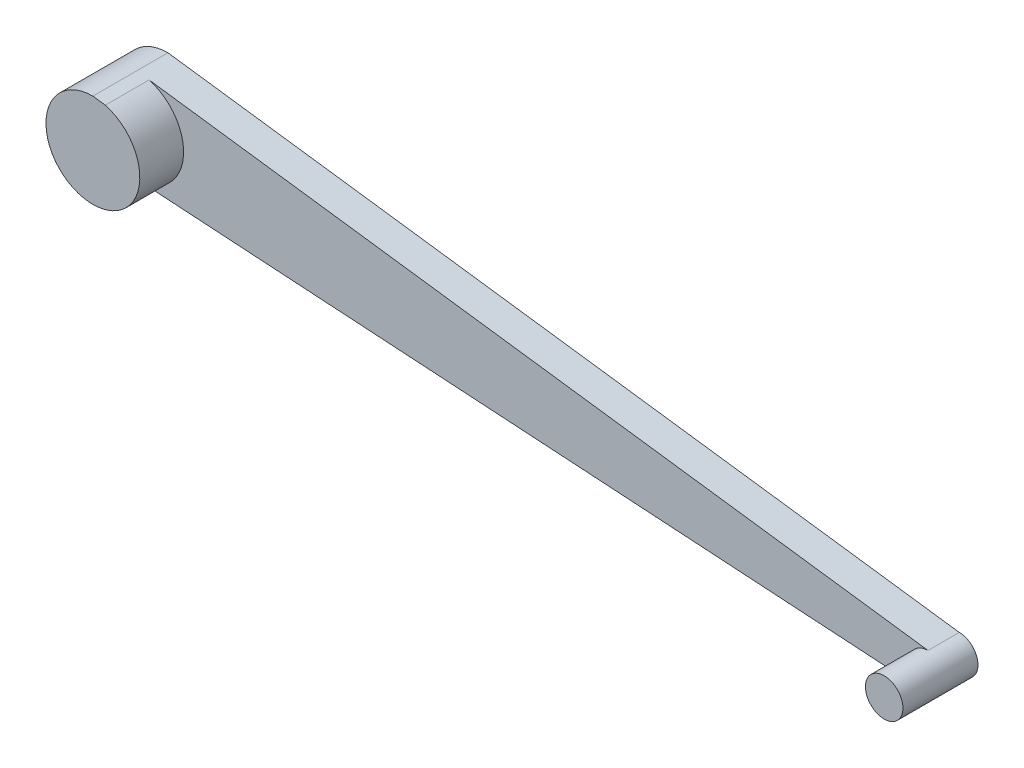
ISO-10303-21;
HEADER;
FILE_DESCRIPTION(('STEP AP214'),'2;1');
FILE_NAME('part.step','',(''),(''),'','','');
FILE_SCHEMA(('AUTOMOTIVE_DESIGN { 1 0 10303 214 1 1 1 1 }'));
ENDSEC;
DATA;
#1=APPLICATION_CONTEXT('core data for automotive mechanical design processes');
#2=APPLICATION_PROTOCOL_DEFINITION('international standard','automotive_design',2000,#1);
#3=PRODUCT_CONTEXT('',#1,'mechanical');
#4=PRODUCT('Part','Part','',(#3));
#5=PRODUCT_RELATED_PRODUCT_CATEGORY('part','',(#4));
#6=PRODUCT_DEFINITION_FORMATION('','',#4);
#7=PRODUCT_DEFINITION_CONTEXT('part definition',#1,'design');
#8=PRODUCT_DEFINITION('design','',#6,#7);
#9=PRODUCT_DEFINITION_SHAPE('','',#8);
#10=(LENGTH_UNIT() NAMED_UNIT(*) SI_UNIT(.MILLI.,.METRE.));
#11=(NAMED_UNIT(*) PLANE_ANGLE_UNIT() SI_UNIT($,.RADIAN.));
#12=(NAMED_UNIT(*) SI_UNIT($,.STERADIAN.) SOLID_ANGLE_UNIT());
#13=UNCERTAINTY_MEASURE_WITH_UNIT(LENGTH_MEASURE(1.E-05),#10,'distance_accuracy_value','');
#14=(GEOMETRIC_REPRESENTATION_CONTEXT(3) GLOBAL_UNCERTAINTY_ASSIGNED_CONTEXT((#13)) GLOBAL_UNIT_ASSIGNED_CONTEXT((#10,
#11,#12)) REPRESENTATION_CONTEXT('',''));
#15=CARTESIAN_POINT('',(0.,0.,0.));
#16=DIRECTION('',(0.,0.,1.));
#17=DIRECTION('',(1.,0.,0.));
#18=AXIS2_PLACEMENT_3D('',#15,#16,#17);
#19=CARTESIAN_POINT('',(-25.3,2.5,2.4));
#20=DIRECTION('',(0.,0.,-1.));
#21=DIRECTION('',(-1.,0.,0.));
#22=AXIS2_PLACEMENT_3D('',#19,#20,#21);
#23=CYLINDRICAL_SURFACE('',#22,1.5);
#24=DIRECTION('',(0.,0.,-1.));
#25=VECTOR('',#24,1.);
#26=CARTESIAN_POINT('',(-25.3,0.999999999999998,1.));
#27=LINE('',#26,#25);
#28=CARTESIAN_POINT('',(-25.3,0.999999999999993,1.));
#29=VERTEX_POINT('',#28);
#30=CARTESIAN_POINT('',(-25.3,0.999999999999993,0.));
#31=VERTEX_POINT('',#30);
#32=EDGE_CURVE('E63',#29,#31,#27,.T.);
#33=ORIENTED_EDGE('',*,*,#32,.F.);
#34=CARTESIAN_POINT('',(-25.3,2.5,1.));
#35=DIRECTION('',(0.,0.,1.));
#36=DIRECTION('',(1.,0.,0.));
#37=AXIS2_PLACEMENT_3D('',#34,#35,#36);
#38=CIRCLE('',#37,1.5);
#39=CARTESIAN_POINT('',(-24.9039898718637,3.94678124760223,1.));
#40=VERTEX_POINT('',#39);
#41=EDGE_CURVE('E68',#29,#40,#38,.T.);
#42=ORIENTED_EDGE('',*,*,#41,.T.);
#43=DIRECTION('',(0.,0.,-1.));
#44=VECTOR('',#43,1.);
#45=CARTESIAN_POINT('',(-24.9039898718637,3.94678124760223,2.4));
#46=LINE('',#45,#44);
#47=CARTESIAN_POINT('',(-24.9039898718637,3.94678124760223,2.4));
#48=VERTEX_POINT('',#47);
#49=EDGE_CURVE('E56',#48,#40,#46,.T.);
#50=ORIENTED_EDGE('',*,*,#49,.F.);
#51=CARTESIAN_POINT('',(-25.3,2.5,2.4));
#52=DIRECTION('',(0.,0.,1.));
#53=DIRECTION('',(1.,0.,0.));
#54=AXIS2_PLACEMENT_3D('',#51,#52,#53);
#55=CIRCLE('',#54,1.5);
#56=CARTESIAN_POINT('',(-25.3,4.,2.4));
#57=VERTEX_POINT('',#56);
#58=EDGE_CURVE('E152',#57,#48,#55,.T.);
#59=ORIENTED_EDGE('',*,*,#58,.F.);
#60=DIRECTION('',(0.,0.,-1.));
#61=VECTOR('',#60,1.);
#62=CARTESIAN_POINT('',(-25.3,4.,2.4));
#63=LINE('',#62,#61);
#64=CARTESIAN_POINT('',(-25.3,4.,0.));
#65=VERTEX_POINT('',#64);
#66=EDGE_CURVE('E11',#57,#65,#63,.T.);
#67=ORIENTED_EDGE('',*,*,#66,.T.);
#68=CARTESIAN_POINT('',(-25.3,2.5,0.));
#69=DIRECTION('',(0.,0.,1.));
#70=DIRECTION('',(1.,0.,0.));
#71=AXIS2_PLACEMENT_3D('',#68,#69,#70);
#72=CIRCLE('',#71,1.5);
#73=EDGE_CURVE('E153',#65,#31,#72,.T.);
#74=ORIENTED_EDGE('',*,*,#73,.T.);
#75=EDGE_LOOP('',(#33,#42,#50,#59,#67,#74));
#76=FACE_BOUND('',#75,.T.);
#77=ADVANCED_FACE('F47',(#76),#23,.T.);
#78=CARTESIAN_POINT('',(0.0792020256272538,0.589356249520448,2.4));
#79=DIRECTION('',(0.133190030154612,0.991090518503438,0.));
#80=DIRECTION('',(-0.991090518503438,0.133190030154612,0.));
#81=AXIS2_PLACEMENT_3D('',#78,#79,#80);
#82=PLANE('',#81);
#83=DIRECTION('',(0.991090518503438,-0.133190030154612,0.));
#84=VECTOR('',#83,1.);
#85=CARTESIAN_POINT('',(0.0792020256272538,0.589356249520448,0.));
#86=LINE('',#85,#84);
#87=CARTESIAN_POINT('',(0.,0.6,0.));
#88=VERTEX_POINT('',#87);
#89=EDGE_CURVE('E147',#65,#88,#86,.T.);
#90=ORIENTED_EDGE('',*,*,#89,.F.);
#91=ORIENTED_EDGE('',*,*,#66,.F.);
#92=DIRECTION('',(0.991090518503438,-0.133190030154612,0.));
#93=VECTOR('',#92,1.);
#94=CARTESIAN_POINT('',(0.0792020256272538,0.589356249520448,2.4));
#95=LINE('',#94,#93);
#96=EDGE_CURVE('E148',#57,#48,#95,.T.);
#97=ORIENTED_EDGE('',*,*,#96,.T.);
#98=ORIENTED_EDGE('',*,*,#49,.T.);
#99=DIRECTION('',(0.991090518503438,-0.133190030154612,0.));
#100=VECTOR('',#99,1.);
#101=CARTESIAN_POINT('',(0.0792020256272538,0.589356249520448,1.));
#102=LINE('',#101,#100);
#103=CARTESIAN_POINT('',(0.,0.6,1.));
#104=VERTEX_POINT('',#103);
#105=EDGE_CURVE('E137',#40,#104,#102,.T.);
#106=ORIENTED_EDGE('',*,*,#105,.T.);
#107=DIRECTION('',(0.,0.,-1.));
#108=VECTOR('',#107,1.);
#109=CARTESIAN_POINT('',(0.,0.6,1.));
#110=LINE('',#109,#108);
#111=EDGE_CURVE('E140',#104,#88,#110,.T.);
#112=ORIENTED_EDGE('',*,*,#111,.T.);
#113=EDGE_LOOP('',(#90,#91,#97,#98,#106,#112));
#114=FACE_BOUND('',#113,.T.);
#115=ADVANCED_FACE('F49',(#114),#82,.T.);
#116=CARTESIAN_POINT('',(0.,0.,2.4));
#117=DIRECTION('',(0.,0.,1.));
#118=DIRECTION('',(1.,0.,0.));
#119=AXIS2_PLACEMENT_3D('',#116,#117,#118);
#120=PLANE('',#119);
#121=ORIENTED_EDGE('',*,*,#96,.F.);
#122=ORIENTED_EDGE('',*,*,#58,.T.);
#123=EDGE_LOOP('',(#121,#122));
#124=FACE_BOUND('',#123,.T.);
#125=ADVANCED_FACE('F175',(#124),#120,.T.);
#126=CARTESIAN_POINT('',(0.,0.,0.));
#127=DIRECTION('',(0.,0.,1.));
#128=DIRECTION('',(1.,0.,0.));
#129=AXIS2_PLACEMENT_3D('',#126,#127,#128);
#130=PLANE('',#129);
#131=ORIENTED_EDGE('',*,*,#89,.T.);
#132=CARTESIAN_POINT('',(0.,0.,0.));
#133=DIRECTION('',(0.,0.,1.));
#134=DIRECTION('',(1.,0.,0.));
#135=AXIS2_PLACEMENT_3D('',#132,#133,#134);
#136=CIRCLE('',#135,0.6);
#137=CARTESIAN_POINT('',(0.,-0.6,0.));
#138=VERTEX_POINT('',#137);
#139=EDGE_CURVE('E115',#138,#88,#136,.T.);
#140=ORIENTED_EDGE('',*,*,#139,.F.);
#141=DIRECTION('',(0.998006259601456,-0.0631150203700524,0.));
#142=VECTOR('',#141,1.);
#143=CARTESIAN_POINT('',(-0.0377935112425114,-0.597609896522212,0.));
#144=LINE('',#143,#142);
#145=EDGE_CURVE('E122',#31,#138,#144,.T.);
#146=ORIENTED_EDGE('',*,*,#145,.F.);
#147=ORIENTED_EDGE('',*,*,#73,.F.);
#148=EDGE_LOOP('',(#131,#140,#146,#147));
#149=FACE_BOUND('',#148,.T.);
#150=ADVANCED_FACE('F171',(#149),#130,.F.);
#151=CARTESIAN_POINT('',(-0.0377935112425114,-0.597609896522212,1.));
#152=DIRECTION('',(0.0631150203700524,0.998006259601456,0.));
#153=DIRECTION('',(-0.998006259601456,0.0631150203700524,0.));
#154=AXIS2_PLACEMENT_3D('',#151,#152,#153);
#155=PLANE('',#154);
#156=ORIENTED_EDGE('',*,*,#145,.T.);
#157=DIRECTION('',(0.,0.,-1.));
#158=VECTOR('',#157,1.);
#159=CARTESIAN_POINT('',(0.,-0.6,2.4));
#160=LINE('',#159,#158);
#161=CARTESIAN_POINT('',(0.,-0.6,2.4));
#162=VERTEX_POINT('',#161);
#163=EDGE_CURVE('E106',#162,#138,#160,.T.);
#164=ORIENTED_EDGE('',*,*,#163,.F.);
#165=DIRECTION('',(0.998006259601456,-0.0631150203700524,0.));
#166=VECTOR('',#165,1.);
#167=CARTESIAN_POINT('',(-0.0377935112425114,-0.597609896522212,2.4));
#168=LINE('',#167,#166);
#169=CARTESIAN_POINT('',(-0.0755870224850251,-0.595219793044425,2.4));
#170=VERTEX_POINT('',#169);
#171=EDGE_CURVE('E100',#170,#162,#168,.T.);
#172=ORIENTED_EDGE('',*,*,#171,.F.);
#173=DIRECTION('',(0.,0.,-1.));
#174=VECTOR('',#173,1.);
#175=CARTESIAN_POINT('',(-0.0755870224850251,-0.595219793044425,2.4));
#176=LINE('',#175,#174);
#177=CARTESIAN_POINT('',(-0.0755870224850251,-0.595219793044425,1.));
#178=VERTEX_POINT('',#177);
#179=EDGE_CURVE('E104',#170,#178,#176,.T.);
#180=ORIENTED_EDGE('',*,*,#179,.T.);
#181=DIRECTION('',(0.998006259601456,-0.0631150203700524,0.));
#182=VECTOR('',#181,1.);
#183=CARTESIAN_POINT('',(-0.0377935112425114,-0.597609896522212,1.));
#184=LINE('',#183,#182);
#185=EDGE_CURVE('E132',#29,#178,#184,.T.);
#186=ORIENTED_EDGE('',*,*,#185,.F.);
#187=ORIENTED_EDGE('',*,*,#32,.T.);
#188=EDGE_LOOP('',(#156,#164,#172,#180,#186,#187));
#189=FACE_BOUND('',#188,.T.);
#190=ADVANCED_FACE('F102',(#189),#155,.F.);
#191=CARTESIAN_POINT('',(0.,0.,1.));
#192=DIRECTION('',(0.,0.,1.));
#193=DIRECTION('',(1.,0.,0.));
#194=AXIS2_PLACEMENT_3D('',#191,#192,#193);
#195=PLANE('',#194);
#196=ORIENTED_EDGE('',*,*,#41,.F.);
#197=ORIENTED_EDGE('',*,*,#185,.T.);
#198=CARTESIAN_POINT('',(0.,0.,1.));
#199=DIRECTION('',(0.,0.,1.));
#200=DIRECTION('',(1.,0.,0.));
#201=AXIS2_PLACEMENT_3D('',#198,#199,#200);
#202=CIRCLE('',#201,0.6);
#203=EDGE_CURVE('E120',#104,#178,#202,.T.);
#204=ORIENTED_EDGE('',*,*,#203,.F.);
#205=ORIENTED_EDGE('',*,*,#105,.F.);
#206=EDGE_LOOP('',(#196,#197,#204,#205));
#207=FACE_BOUND('',#206,.T.);
#208=ADVANCED_FACE('F166',(#207),#195,.T.);
#209=CARTESIAN_POINT('',(0.,0.,2.4));
#210=DIRECTION('',(0.,0.,-1.));
#211=DIRECTION('',(-1.,0.,0.));
#212=AXIS2_PLACEMENT_3D('',#209,#210,#211);
#213=CYLINDRICAL_SURFACE('',#212,0.6);
#214=ORIENTED_EDGE('',*,*,#111,.F.);
#215=ORIENTED_EDGE('',*,*,#203,.T.);
#216=ORIENTED_EDGE('',*,*,#179,.F.);
#217=CARTESIAN_POINT('',(0.,0.,2.4));
#218=DIRECTION('',(0.,0.,1.));
#219=DIRECTION('',(1.,0.,0.));
#220=AXIS2_PLACEMENT_3D('',#217,#218,#219);
#221=CIRCLE('',#220,0.6);
#222=EDGE_CURVE('E110',#162,#170,#221,.T.);
#223=ORIENTED_EDGE('',*,*,#222,.F.);
#224=ORIENTED_EDGE('',*,*,#163,.T.);
#225=ORIENTED_EDGE('',*,*,#139,.T.);
#226=EDGE_LOOP('',(#214,#215,#216,#223,#224,#225));
#227=FACE_BOUND('',#226,.T.);
#228=ADVANCED_FACE('F119',(#227),#213,.T.);
#229=CARTESIAN_POINT('',(0.,0.,2.4));
#230=DIRECTION('',(0.,0.,1.));
#231=DIRECTION('',(1.,0.,0.));
#232=AXIS2_PLACEMENT_3D('',#229,#230,#231);
#233=PLANE('',#232);
#234=ORIENTED_EDGE('',*,*,#222,.T.);
#235=ORIENTED_EDGE('',*,*,#171,.T.);
#236=EDGE_LOOP('',(#234,#235));
#237=FACE_BOUND('',#236,.T.);
#238=ADVANCED_FACE('F112',(#237),#233,.T.);
#239=CLOSED_SHELL('',(#77,#115,#125,#150,#190,#208,#228,#238));
#240=MANIFOLD_SOLID_BREP('B2',#239);
#241=ADVANCED_BREP_SHAPE_REPRESENTATION('',(#18,#240),#14);
#242=SHAPE_DEFINITION_REPRESENTATION(#9,#241);
ENDSEC;
END-ISO-10303-21;
